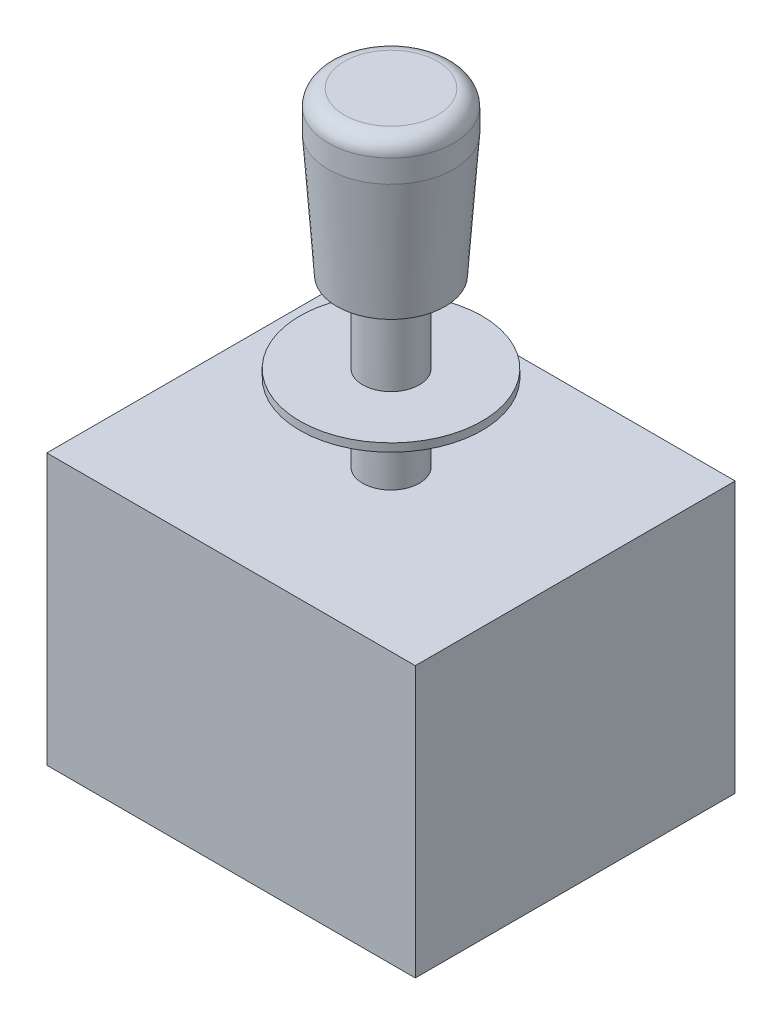
ISO-10303-21;
HEADER;
FILE_DESCRIPTION(('STEP AP214'),'2;1');
FILE_NAME('part.step','',(''),(''),'','','');
FILE_SCHEMA(('AUTOMOTIVE_DESIGN { 1 0 10303 214 1 1 1 1 }'));
ENDSEC;
DATA;
#1=APPLICATION_CONTEXT('core data for automotive mechanical design processes');
#2=APPLICATION_PROTOCOL_DEFINITION('international standard','automotive_design',2000,#1);
#3=PRODUCT_CONTEXT('',#1,'mechanical');
#4=PRODUCT('Part','Part','',(#3));
#5=PRODUCT_RELATED_PRODUCT_CATEGORY('part','',(#4));
#6=PRODUCT_DEFINITION_FORMATION('','',#4);
#7=PRODUCT_DEFINITION_CONTEXT('part definition',#1,'design');
#8=PRODUCT_DEFINITION('design','',#6,#7);
#9=PRODUCT_DEFINITION_SHAPE('','',#8);
#10=(LENGTH_UNIT() NAMED_UNIT(*) SI_UNIT(.MILLI.,.METRE.));
#11=(NAMED_UNIT(*) PLANE_ANGLE_UNIT() SI_UNIT($,.RADIAN.));
#12=(NAMED_UNIT(*) SI_UNIT($,.STERADIAN.) SOLID_ANGLE_UNIT());
#13=UNCERTAINTY_MEASURE_WITH_UNIT(LENGTH_MEASURE(1.E-05),#10,'distance_accuracy_value','');
#14=(GEOMETRIC_REPRESENTATION_CONTEXT(3) GLOBAL_UNCERTAINTY_ASSIGNED_CONTEXT((#13)) GLOBAL_UNIT_ASSIGNED_CONTEXT((#10,
#11,#12)) REPRESENTATION_CONTEXT('',''));
#15=CARTESIAN_POINT('',(0.,0.,0.));
#16=DIRECTION('',(0.,0.,1.));
#17=DIRECTION('',(1.,0.,0.));
#18=AXIS2_PLACEMENT_3D('',#15,#16,#17);
#19=CARTESIAN_POINT('',(0.,0.,0.));
#20=DIRECTION('',(0.,1.,0.));
#21=DIRECTION('',(0.,0.,1.));
#22=AXIS2_PLACEMENT_3D('',#19,#20,#21);
#23=CYLINDRICAL_SURFACE('',#22,7.);
#24=CARTESIAN_POINT('',(0.,41.,0.));
#25=DIRECTION('',(0.,1.,0.));
#26=DIRECTION('',(0.,0.,1.));
#27=AXIS2_PLACEMENT_3D('',#24,#25,#26);
#28=CIRCLE('',#27,7.);
#29=CARTESIAN_POINT('',(0.,41.,7.));
#30=VERTEX_POINT('',#29);
#31=EDGE_CURVE('E11',#30,#30,#28,.T.);
#32=ORIENTED_EDGE('',*,*,#31,.F.);
#33=EDGE_LOOP('',(#32));
#34=FACE_BOUND('',#33,.T.);
#35=CARTESIAN_POINT('',(0.,21.05,0.));
#36=DIRECTION('',(0.,-1.,0.));
#37=DIRECTION('',(0.,0.,-1.));
#38=AXIS2_PLACEMENT_3D('',#35,#36,#37);
#39=CIRCLE('',#38,7.);
#40=CARTESIAN_POINT('',(0.,21.05,-7.00000000000006));
#41=VERTEX_POINT('',#40);
#42=EDGE_CURVE('E131',#41,#41,#39,.T.);
#43=ORIENTED_EDGE('',*,*,#42,.F.);
#44=EDGE_LOOP('',(#43));
#45=FACE_BOUND('',#44,.T.);
#46=ADVANCED_FACE('F40',(#34,#45),#23,.T.);
#47=CARTESIAN_POINT('',(-7.00000000000001,41.,0.));
#48=DIRECTION('',(0.,-1.,0.));
#49=DIRECTION('',(0.,0.,-1.));
#50=AXIS2_PLACEMENT_3D('',#47,#48,#49);
#51=PLANE('',#50);
#52=ORIENTED_EDGE('',*,*,#31,.T.);
#53=EDGE_LOOP('',(#52));
#54=FACE_BOUND('',#53,.T.);
#55=CARTESIAN_POINT('',(0.,41.,0.));
#56=DIRECTION('',(0.,1.,0.));
#57=DIRECTION('',(0.,0.,1.));
#58=AXIS2_PLACEMENT_3D('',#55,#56,#57);
#59=CIRCLE('',#58,13.3696533160936);
#60=CARTESIAN_POINT('',(0.,41.,13.3696533160936));
#61=VERTEX_POINT('',#60);
#62=EDGE_CURVE('E51',#61,#61,#59,.T.);
#63=ORIENTED_EDGE('',*,*,#62,.F.);
#64=EDGE_LOOP('',(#63));
#65=FACE_BOUND('',#64,.T.);
#66=ADVANCED_FACE('F167',(#54,#65),#51,.T.);
#67=CARTESIAN_POINT('',(0.,71.4018449650773,0.));
#68=DIRECTION('',(0.,1.,0.));
#69=DIRECTION('',(0.,0.,1.));
#70=AXIS2_PLACEMENT_3D('',#67,#68,#69);
#71=CONICAL_SURFACE('',#70,15.5,0.0699585864462781);
#72=ORIENTED_EDGE('',*,*,#62,.T.);
#73=EDGE_LOOP('',(#72));
#74=FACE_BOUND('',#73,.T.);
#75=CARTESIAN_POINT('',(0.,71.4018449650773,0.));
#76=DIRECTION('',(0.,1.,0.));
#77=DIRECTION('',(0.,0.,1.));
#78=AXIS2_PLACEMENT_3D('',#75,#76,#77);
#79=CIRCLE('',#78,15.5);
#80=CARTESIAN_POINT('',(0.,71.4018449650773,15.5));
#81=VERTEX_POINT('',#80);
#82=EDGE_CURVE('E155',#81,#81,#79,.T.);
#83=ORIENTED_EDGE('',*,*,#82,.F.);
#84=EDGE_LOOP('',(#83));
#85=FACE_BOUND('',#84,.T.);
#86=ADVANCED_FACE('F164',(#74,#85),#71,.T.);
#87=CARTESIAN_POINT('',(0.,0.,0.));
#88=DIRECTION('',(0.,1.,0.));
#89=DIRECTION('',(0.,0.,1.));
#90=AXIS2_PLACEMENT_3D('',#87,#88,#89);
#91=CYLINDRICAL_SURFACE('',#90,15.5);
#92=ORIENTED_EDGE('',*,*,#82,.T.);
#93=EDGE_LOOP('',(#92));
#94=FACE_BOUND('',#93,.T.);
#95=CARTESIAN_POINT('',(0.,77.,-2.77555756156289E-13));
#96=DIRECTION('',(0.,1.,0.));
#97=DIRECTION('',(0.,0.,1.));
#98=AXIS2_PLACEMENT_3D('',#95,#96,#97);
#99=CIRCLE('',#98,15.5);
#100=CARTESIAN_POINT('',(0.,77.,15.4999999999997));
#101=VERTEX_POINT('',#100);
#102=EDGE_CURVE('E151',#101,#101,#99,.T.);
#103=ORIENTED_EDGE('',*,*,#102,.F.);
#104=EDGE_LOOP('',(#103));
#105=FACE_BOUND('',#104,.T.);
#106=ADVANCED_FACE('F174',(#94,#105),#91,.T.);
#107=CARTESIAN_POINT('',(0.,77.,-3.33066907387547E-13));
#108=DIRECTION('',(0.,1.,0.));
#109=DIRECTION('',(0.,0.,1.));
#110=AXIS2_PLACEMENT_3D('',#107,#108,#109);
#111=TOROIDAL_SURFACE('',#110,11.5,4.);
#112=ORIENTED_EDGE('',*,*,#102,.T.);
#113=EDGE_LOOP('',(#112));
#114=FACE_BOUND('',#113,.T.);
#115=CARTESIAN_POINT('',(0.,81.,-1.66533453693773E-13));
#116=DIRECTION('',(0.,1.,0.));
#117=DIRECTION('',(0.,0.,1.));
#118=AXIS2_PLACEMENT_3D('',#115,#116,#117);
#119=CIRCLE('',#118,11.5);
#120=CARTESIAN_POINT('',(0.,81.,11.4999999999998));
#121=VERTEX_POINT('',#120);
#122=EDGE_CURVE('E147',#121,#121,#119,.T.);
#123=ORIENTED_EDGE('',*,*,#122,.F.);
#124=EDGE_LOOP('',(#123));
#125=FACE_BOUND('',#124,.T.);
#126=ADVANCED_FACE('F180',(#114,#125),#111,.T.);
#127=CARTESIAN_POINT('',(-11.4999999999998,81.,-1.66533453693773E-13));
#128=DIRECTION('',(0.,1.,0.));
#129=DIRECTION('',(0.,0.,1.));
#130=AXIS2_PLACEMENT_3D('',#127,#128,#129);
#131=PLANE('',#130);
#132=ORIENTED_EDGE('',*,*,#122,.T.);
#133=EDGE_LOOP('',(#132));
#134=FACE_BOUND('',#133,.T.);
#135=ADVANCED_FACE('F184',(#134),#131,.T.);
#136=CARTESIAN_POINT('',(-7.00000000000001,19.05,0.));
#137=DIRECTION('',(0.,1.,0.));
#138=DIRECTION('',(0.,0.,1.));
#139=AXIS2_PLACEMENT_3D('',#136,#137,#138);
#140=PLANE('',#139);
#141=CARTESIAN_POINT('',(0.,19.05,0.));
#142=DIRECTION('',(0.,-1.,0.));
#143=DIRECTION('',(0.,0.,-1.));
#144=AXIS2_PLACEMENT_3D('',#141,#142,#143);
#145=CIRCLE('',#144,6.99999999999999);
#146=CARTESIAN_POINT('',(0.,19.05,-6.99999999999999));
#147=VERTEX_POINT('',#146);
#148=EDGE_CURVE('E143',#147,#147,#145,.T.);
#149=ORIENTED_EDGE('',*,*,#148,.F.);
#150=EDGE_LOOP('',(#149));
#151=FACE_BOUND('',#150,.T.);
#152=CARTESIAN_POINT('',(0.,19.05,0.));
#153=DIRECTION('',(0.,-1.,0.));
#154=DIRECTION('',(0.,0.,-1.));
#155=AXIS2_PLACEMENT_3D('',#152,#153,#154);
#156=CIRCLE('',#155,22.5);
#157=CARTESIAN_POINT('',(0.,19.05,-22.5));
#158=VERTEX_POINT('',#157);
#159=EDGE_CURVE('E139',#158,#158,#156,.T.);
#160=ORIENTED_EDGE('',*,*,#159,.T.);
#161=EDGE_LOOP('',(#160));
#162=FACE_BOUND('',#161,.T.);
#163=ADVANCED_FACE('F188',(#151,#162),#140,.F.);
#164=CARTESIAN_POINT('',(0.,0.,0.));
#165=DIRECTION('',(0.,-1.,0.));
#166=DIRECTION('',(0.,0.,-1.));
#167=AXIS2_PLACEMENT_3D('',#164,#165,#166);
#168=CYLINDRICAL_SURFACE('',#167,22.5);
#169=ORIENTED_EDGE('',*,*,#159,.F.);
#170=EDGE_LOOP('',(#169));
#171=FACE_BOUND('',#170,.T.);
#172=CARTESIAN_POINT('',(0.,21.05,0.));
#173=DIRECTION('',(0.,-1.,0.));
#174=DIRECTION('',(0.,0.,-1.));
#175=AXIS2_PLACEMENT_3D('',#172,#173,#174);
#176=CIRCLE('',#175,22.5);
#177=CARTESIAN_POINT('',(0.,21.05,-22.5000000000001));
#178=VERTEX_POINT('',#177);
#179=EDGE_CURVE('E135',#178,#178,#176,.T.);
#180=ORIENTED_EDGE('',*,*,#179,.T.);
#181=EDGE_LOOP('',(#180));
#182=FACE_BOUND('',#181,.T.);
#183=ADVANCED_FACE('F192',(#171,#182),#168,.T.);
#184=CARTESIAN_POINT('',(-7.00000000000001,21.05,0.));
#185=DIRECTION('',(0.,-1.,0.));
#186=DIRECTION('',(0.,0.,-1.));
#187=AXIS2_PLACEMENT_3D('',#184,#185,#186);
#188=PLANE('',#187);
#189=ORIENTED_EDGE('',*,*,#179,.F.);
#190=EDGE_LOOP('',(#189));
#191=FACE_BOUND('',#190,.T.);
#192=ORIENTED_EDGE('',*,*,#42,.T.);
#193=EDGE_LOOP('',(#192));
#194=FACE_BOUND('',#193,.T.);
#195=ADVANCED_FACE('F196',(#191,#194),#188,.F.);
#196=CARTESIAN_POINT('',(0.,0.,0.));
#197=DIRECTION('',(0.,1.,0.));
#198=DIRECTION('',(0.,0.,1.));
#199=AXIS2_PLACEMENT_3D('',#196,#197,#198);
#200=CIRCLE('',#199,7.);
#201=CARTESIAN_POINT('',(0.,0.,7.));
#202=VERTEX_POINT('',#201);
#203=EDGE_CURVE('E44',#202,#202,#200,.T.);
#204=ORIENTED_EDGE('',*,*,#203,.T.);
#205=EDGE_LOOP('',(#204));
#206=FACE_BOUND('',#205,.T.);
#207=ORIENTED_EDGE('',*,*,#148,.T.);
#208=EDGE_LOOP('',(#207));
#209=FACE_BOUND('',#208,.T.);
#210=ADVANCED_FACE('F42',(#206,#209),#23,.T.);
#211=CARTESIAN_POINT('',(-45.5,-66.8,39.4999999999998));
#212=DIRECTION('',(1.,0.,0.));
#213=DIRECTION('',(0.,0.,-1.));
#214=AXIS2_PLACEMENT_3D('',#211,#212,#213);
#215=PLANE('',#214);
#216=DIRECTION('',(0.,0.,-1.));
#217=VECTOR('',#216,1.);
#218=CARTESIAN_POINT('',(-45.5,0.,39.5));
#219=LINE('',#218,#217);
#220=CARTESIAN_POINT('',(-45.5,0.,39.5));
#221=VERTEX_POINT('',#220);
#222=CARTESIAN_POINT('',(-45.5,0.,-39.5000000000001));
#223=VERTEX_POINT('',#222);
#224=EDGE_CURVE('E115',#221,#223,#219,.T.);
#225=ORIENTED_EDGE('',*,*,#224,.T.);
#226=DIRECTION('',(0.,1.,0.));
#227=VECTOR('',#226,1.);
#228=CARTESIAN_POINT('',(-45.5,-66.8000000000002,-39.5000000000003));
#229=LINE('',#228,#227);
#230=CARTESIAN_POINT('',(-45.5,-66.8000000000002,-39.5000000000003));
#231=VERTEX_POINT('',#230);
#232=EDGE_CURVE('E103',#231,#223,#229,.T.);
#233=ORIENTED_EDGE('',*,*,#232,.F.);
#234=DIRECTION('',(0.,0.,-1.));
#235=VECTOR('',#234,1.);
#236=CARTESIAN_POINT('',(-45.5,-66.8,39.4999999999998));
#237=LINE('',#236,#235);
#238=CARTESIAN_POINT('',(-45.5,-66.8,39.4999999999998));
#239=VERTEX_POINT('',#238);
#240=EDGE_CURVE('E95',#239,#231,#237,.T.);
#241=ORIENTED_EDGE('',*,*,#240,.F.);
#242=DIRECTION('',(0.,1.,0.));
#243=VECTOR('',#242,1.);
#244=CARTESIAN_POINT('',(-45.5,-66.8,39.4999999999998));
#245=LINE('',#244,#243);
#246=EDGE_CURVE('E111',#239,#221,#245,.T.);
#247=ORIENTED_EDGE('',*,*,#246,.T.);
#248=EDGE_LOOP('',(#225,#233,#241,#247));
#249=FACE_BOUND('',#248,.T.);
#250=ADVANCED_FACE('F201',(#249),#215,.F.);
#251=CARTESIAN_POINT('',(45.5,-66.8,-39.5000000000001));
#252=DIRECTION('',(0.,0.,1.));
#253=DIRECTION('',(1.,0.,0.));
#254=AXIS2_PLACEMENT_3D('',#251,#252,#253);
#255=PLANE('',#254);
#256=DIRECTION('',(1.,0.,0.));
#257=VECTOR('',#256,1.);
#258=CARTESIAN_POINT('',(45.5000000000001,0.,-39.5000000000003));
#259=LINE('',#258,#257);
#260=CARTESIAN_POINT('',(45.5000000000001,0.,-39.5000000000003));
#261=VERTEX_POINT('',#260);
#262=EDGE_CURVE('E101',#223,#261,#259,.T.);
#263=ORIENTED_EDGE('',*,*,#262,.T.);
#264=DIRECTION('',(0.,1.,0.));
#265=VECTOR('',#264,1.);
#266=CARTESIAN_POINT('',(45.5,-66.8,-39.5000000000001));
#267=LINE('',#266,#265);
#268=CARTESIAN_POINT('',(45.5,-66.8,-39.5000000000001));
#269=VERTEX_POINT('',#268);
#270=EDGE_CURVE('E99',#269,#261,#267,.T.);
#271=ORIENTED_EDGE('',*,*,#270,.F.);
#272=DIRECTION('',(1.,0.,0.));
#273=VECTOR('',#272,1.);
#274=CARTESIAN_POINT('',(45.5,-66.8,-39.5000000000001));
#275=LINE('',#274,#273);
#276=EDGE_CURVE('E90',#231,#269,#275,.T.);
#277=ORIENTED_EDGE('',*,*,#276,.F.);
#278=ORIENTED_EDGE('',*,*,#232,.T.);
#279=EDGE_LOOP('',(#263,#271,#277,#278));
#280=FACE_BOUND('',#279,.T.);
#281=ADVANCED_FACE('F100',(#280),#255,.F.);
#282=CARTESIAN_POINT('',(45.5,-66.8,39.4999999999998));
#283=DIRECTION('',(-1.,0.,0.));
#284=DIRECTION('',(0.,0.,1.));
#285=AXIS2_PLACEMENT_3D('',#282,#283,#284);
#286=PLANE('',#285);
#287=DIRECTION('',(0.,0.,1.));
#288=VECTOR('',#287,1.);
#289=CARTESIAN_POINT('',(45.5000000000001,0.,39.4999999999999));
#290=LINE('',#289,#288);
#291=CARTESIAN_POINT('',(45.5000000000001,0.,39.4999999999999));
#292=VERTEX_POINT('',#291);
#293=EDGE_CURVE('E76',#261,#292,#290,.T.);
#294=ORIENTED_EDGE('',*,*,#293,.T.);
#295=DIRECTION('',(0.,1.,0.));
#296=VECTOR('',#295,1.);
#297=CARTESIAN_POINT('',(45.5,-66.8,39.4999999999998));
#298=LINE('',#297,#296);
#299=CARTESIAN_POINT('',(45.5,-66.8,39.4999999999998));
#300=VERTEX_POINT('',#299);
#301=EDGE_CURVE('E104',#300,#292,#298,.T.);
#302=ORIENTED_EDGE('',*,*,#301,.F.);
#303=DIRECTION('',(0.,0.,1.));
#304=VECTOR('',#303,1.);
#305=CARTESIAN_POINT('',(45.5,-66.8,39.4999999999998));
#306=LINE('',#305,#304);
#307=EDGE_CURVE('E93',#269,#300,#306,.T.);
#308=ORIENTED_EDGE('',*,*,#307,.F.);
#309=ORIENTED_EDGE('',*,*,#270,.T.);
#310=EDGE_LOOP('',(#294,#302,#308,#309));
#311=FACE_BOUND('',#310,.T.);
#312=ADVANCED_FACE('F106',(#311),#286,.F.);
#313=CARTESIAN_POINT('',(45.5,-66.8,39.4999999999998));
#314=DIRECTION('',(0.,0.,-1.));
#315=DIRECTION('',(-1.,0.,0.));
#316=AXIS2_PLACEMENT_3D('',#313,#314,#315);
#317=PLANE('',#316);
#318=DIRECTION('',(-1.,0.,0.));
#319=VECTOR('',#318,1.);
#320=CARTESIAN_POINT('',(45.5000000000001,0.,39.4999999999999));
#321=LINE('',#320,#319);
#322=EDGE_CURVE('E82',#292,#221,#321,.T.);
#323=ORIENTED_EDGE('',*,*,#322,.T.);
#324=ORIENTED_EDGE('',*,*,#246,.F.);
#325=DIRECTION('',(-1.,0.,0.));
#326=VECTOR('',#325,1.);
#327=CARTESIAN_POINT('',(45.5,-66.8,39.4999999999998));
#328=LINE('',#327,#326);
#329=EDGE_CURVE('E59',#300,#239,#328,.T.);
#330=ORIENTED_EDGE('',*,*,#329,.F.);
#331=ORIENTED_EDGE('',*,*,#301,.T.);
#332=EDGE_LOOP('',(#323,#324,#330,#331));
#333=FACE_BOUND('',#332,.T.);
#334=ADVANCED_FACE('F209',(#333),#317,.F.);
#335=CARTESIAN_POINT('',(0.,-66.8,-3.33066907387547E-13));
#336=DIRECTION('',(0.,1.,0.));
#337=DIRECTION('',(0.,0.,1.));
#338=AXIS2_PLACEMENT_3D('',#335,#336,#337);
#339=PLANE('',#338);
#340=ORIENTED_EDGE('',*,*,#240,.T.);
#341=ORIENTED_EDGE('',*,*,#276,.T.);
#342=ORIENTED_EDGE('',*,*,#307,.T.);
#343=ORIENTED_EDGE('',*,*,#329,.T.);
#344=EDGE_LOOP('',(#340,#341,#342,#343));
#345=FACE_BOUND('',#344,.T.);
#346=ADVANCED_FACE('F91',(#345),#339,.F.);
#347=CARTESIAN_POINT('',(0.,0.,0.));
#348=DIRECTION('',(0.,1.,0.));
#349=DIRECTION('',(0.,0.,1.));
#350=AXIS2_PLACEMENT_3D('',#347,#348,#349);
#351=PLANE('',#350);
#352=ORIENTED_EDGE('',*,*,#203,.F.);
#353=EDGE_LOOP('',(#352));
#354=FACE_BOUND('',#353,.T.);
#355=ORIENTED_EDGE('',*,*,#224,.F.);
#356=ORIENTED_EDGE('',*,*,#322,.F.);
#357=ORIENTED_EDGE('',*,*,#293,.F.);
#358=ORIENTED_EDGE('',*,*,#262,.F.);
#359=EDGE_LOOP('',(#355,#356,#357,#358));
#360=FACE_BOUND('',#359,.T.);
#361=ADVANCED_FACE('F212',(#354,#360),#351,.T.);
#362=CLOSED_SHELL('',(#46,#66,#86,#106,#126,#135,#163,#183,#195,#210,#250,#281,#312,#334,#346,#361));
#363=MANIFOLD_SOLID_BREP('B2',#362);
#364=ADVANCED_BREP_SHAPE_REPRESENTATION('',(#18,#363),#14);
#365=SHAPE_DEFINITION_REPRESENTATION(#9,#364);
ENDSEC;
END-ISO-10303-21;
